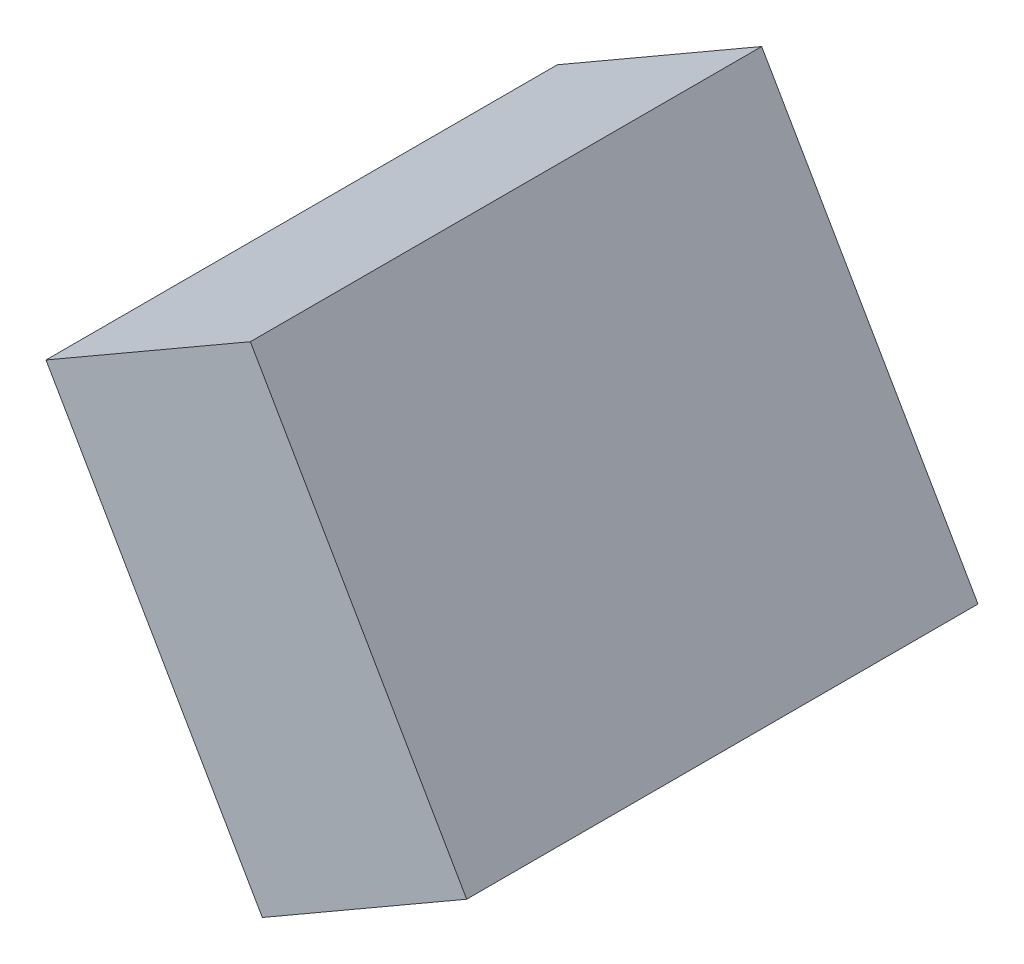
ISO-10303-21;
HEADER;
FILE_DESCRIPTION(('STEP AP214'),'2;1');
FILE_NAME('part.step','',(''),(''),'','','');
FILE_SCHEMA(('AUTOMOTIVE_DESIGN { 1 0 10303 214 1 1 1 1 }'));
ENDSEC;
DATA;
#1=APPLICATION_CONTEXT('core data for automotive mechanical design processes');
#2=APPLICATION_PROTOCOL_DEFINITION('international standard','automotive_design',2000,#1);
#3=PRODUCT_CONTEXT('',#1,'mechanical');
#4=PRODUCT('Part','Part','',(#3));
#5=PRODUCT_RELATED_PRODUCT_CATEGORY('part','',(#4));
#6=PRODUCT_DEFINITION_FORMATION('','',#4);
#7=PRODUCT_DEFINITION_CONTEXT('part definition',#1,'design');
#8=PRODUCT_DEFINITION('design','',#6,#7);
#9=PRODUCT_DEFINITION_SHAPE('','',#8);
#10=(LENGTH_UNIT() NAMED_UNIT(*) SI_UNIT(.MILLI.,.METRE.));
#11=(NAMED_UNIT(*) PLANE_ANGLE_UNIT() SI_UNIT($,.RADIAN.));
#12=(NAMED_UNIT(*) SI_UNIT($,.STERADIAN.) SOLID_ANGLE_UNIT());
#13=UNCERTAINTY_MEASURE_WITH_UNIT(LENGTH_MEASURE(1.E-05),#10,'distance_accuracy_value','');
#14=(GEOMETRIC_REPRESENTATION_CONTEXT(3) GLOBAL_UNCERTAINTY_ASSIGNED_CONTEXT((#13)) GLOBAL_UNIT_ASSIGNED_CONTEXT((#10,
#11,#12)) REPRESENTATION_CONTEXT('',''));
#15=CARTESIAN_POINT('',(0.,0.,0.));
#16=DIRECTION('',(0.,0.,1.));
#17=DIRECTION('',(1.,0.,0.));
#18=AXIS2_PLACEMENT_3D('',#15,#16,#17);
#19=CARTESIAN_POINT('',(-0.53480462,0.3263138,0.));
#20=DIRECTION('',(0.866024622348075,0.500001353485043,0.));
#21=DIRECTION('',(-0.500001353485043,0.866024622348075,0.));
#22=AXIS2_PLACEMENT_3D('',#19,#20,#21);
#23=PLANE('',#22);
#24=DIRECTION('',(0.,0.,1.));
#25=VECTOR('',#24,1.);
#26=CARTESIAN_POINT('',(0.01519682,-0.6263132,0.));
#27=LINE('',#26,#25);
#28=CARTESIAN_POINT('',(0.0151968199998915,-0.626313200000063,0.));
#29=VERTEX_POINT('',#28);
#30=CARTESIAN_POINT('',(0.0151968199998915,-0.626313200000063,1.29999994));
#31=VERTEX_POINT('',#30);
#32=EDGE_CURVE('E20',#29,#31,#27,.T.);
#33=ORIENTED_EDGE('',*,*,#32,.T.);
#34=DIRECTION('',(-0.500001353485438,0.866024622347847,0.));
#35=VECTOR('',#34,1.);
#36=CARTESIAN_POINT('',(0.01519682,-0.6263132,1.29999994));
#37=LINE('',#36,#35);
#38=CARTESIAN_POINT('',(-0.534804620000028,0.326313800000049,1.29999994));
#39=VERTEX_POINT('',#38);
#40=EDGE_CURVE('E55',#31,#39,#37,.T.);
#41=ORIENTED_EDGE('',*,*,#40,.T.);
#42=DIRECTION('',(0.,0.,1.));
#43=VECTOR('',#42,1.);
#44=CARTESIAN_POINT('',(-0.534804620000113,0.326313800000195,0.));
#45=LINE('',#44,#43);
#46=CARTESIAN_POINT('',(-0.534804620000056,0.326313800000098,0.));
#47=VERTEX_POINT('',#46);
#48=EDGE_CURVE('E76',#39,#47,#45,.F.);
#49=ORIENTED_EDGE('',*,*,#48,.T.);
#50=DIRECTION('',(-0.500001353485438,0.866024622347847,0.));
#51=VECTOR('',#50,1.);
#52=CARTESIAN_POINT('',(0.01519682,-0.6263132,0.));
#53=LINE('',#52,#51);
#54=EDGE_CURVE('E58',#29,#47,#53,.T.);
#55=ORIENTED_EDGE('',*,*,#54,.F.);
#56=EDGE_LOOP('',(#33,#41,#49,#55));
#57=FACE_BOUND('',#56,.T.);
#58=ADVANCED_FACE('F17',(#57),#23,.F.);
#59=CARTESIAN_POINT('',(0.01519682,-0.6263132,0.));
#60=DIRECTION('',(-0.499999612904881,0.866025627273794,0.));
#61=DIRECTION('',(-0.866025627273794,-0.499999612904881,0.));
#62=AXIS2_PLACEMENT_3D('',#59,#60,#61);
#63=PLANE('',#62);
#64=DIRECTION('',(0.,0.,1.));
#65=VECTOR('',#64,1.);
#66=CARTESIAN_POINT('',(0.53480716,-0.32631634,0.));
#67=LINE('',#66,#65);
#68=CARTESIAN_POINT('',(0.534807160000074,-0.326316340000128,0.));
#69=VERTEX_POINT('',#68);
#70=CARTESIAN_POINT('',(0.534807160000074,-0.326316340000128,1.29999994));
#71=VERTEX_POINT('',#70);
#72=EDGE_CURVE('E73',#69,#71,#67,.T.);
#73=ORIENTED_EDGE('',*,*,#72,.T.);
#74=DIRECTION('',(-0.866025627273549,-0.499999612905307,0.));
#75=VECTOR('',#74,1.);
#76=CARTESIAN_POINT('',(0.53480716,-0.32631634,1.29999994));
#77=LINE('',#76,#75);
#78=EDGE_CURVE('E63',#71,#31,#77,.T.);
#79=ORIENTED_EDGE('',*,*,#78,.T.);
#80=ORIENTED_EDGE('',*,*,#32,.F.);
#81=DIRECTION('',(-0.866025627273549,-0.499999612905307,0.));
#82=VECTOR('',#81,1.);
#83=CARTESIAN_POINT('',(0.53480716,-0.32631634,0.));
#84=LINE('',#83,#82);
#85=EDGE_CURVE('E79',#69,#29,#84,.T.);
#86=ORIENTED_EDGE('',*,*,#85,.F.);
#87=EDGE_LOOP('',(#73,#79,#80,#86));
#88=FACE_BOUND('',#87,.T.);
#89=ADVANCED_FACE('F72',(#88),#63,.F.);
#90=CARTESIAN_POINT('',(-0.53480462,0.3263138,1.29999994));
#91=DIRECTION('',(0.,0.,-1.));
#92=DIRECTION('',(-1.,0.,0.));
#93=AXIS2_PLACEMENT_3D('',#90,#91,#92);
#94=PLANE('',#93);
#95=ORIENTED_EDGE('',*,*,#78,.F.);
#96=DIRECTION('',(0.499998621801984,-0.866026199485972,0.));
#97=VECTOR('',#96,1.);
#98=CARTESIAN_POINT('',(0.53480716,-0.32631634,1.29999994));
#99=LINE('',#98,#97);
#100=CARTESIAN_POINT('',(-0.0151917399998767,0.626313200000077,1.29999994));
#101=VERTEX_POINT('',#100);
#102=EDGE_CURVE('E83',#71,#101,#99,.F.);
#103=ORIENTED_EDGE('',*,*,#102,.T.);
#104=DIRECTION('',(0.8660248525152,0.500000954825115,0.));
#105=VECTOR('',#104,1.);
#106=CARTESIAN_POINT('',(-0.01519174000001,0.6263132,1.29999994));
#107=LINE('',#106,#105);
#108=EDGE_CURVE('E69',#101,#39,#107,.F.);
#109=ORIENTED_EDGE('',*,*,#108,.T.);
#110=ORIENTED_EDGE('',*,*,#40,.F.);
#111=EDGE_LOOP('',(#95,#103,#109,#110));
#112=FACE_BOUND('',#111,.T.);
#113=ADVANCED_FACE('F66',(#112),#94,.F.);
#114=CARTESIAN_POINT('',(-0.01519174000001,0.6263132,0.));
#115=DIRECTION('',(0.500000954825115,-0.8660248525152,0.));
#116=DIRECTION('',(0.8660248525152,0.500000954825115,0.));
#117=AXIS2_PLACEMENT_3D('',#114,#115,#116);
#118=PLANE('',#117);
#119=ORIENTED_EDGE('',*,*,#48,.F.);
#120=ORIENTED_EDGE('',*,*,#108,.F.);
#121=DIRECTION('',(0.,0.,1.));
#122=VECTOR('',#121,1.);
#123=CARTESIAN_POINT('',(-0.0151917399994766,0.626313200000308,0.));
#124=LINE('',#123,#122);
#125=CARTESIAN_POINT('',(-0.0151917399998767,0.626313200000077,0.));
#126=VERTEX_POINT('',#125);
#127=EDGE_CURVE('E26',#101,#126,#124,.F.);
#128=ORIENTED_EDGE('',*,*,#127,.T.);
#129=DIRECTION('',(0.866024852515012,0.500000954825441,0.));
#130=VECTOR('',#129,1.);
#131=CARTESIAN_POINT('',(-0.53480462,0.3263138,0.));
#132=LINE('',#131,#130);
#133=EDGE_CURVE('E34',#47,#126,#132,.T.);
#134=ORIENTED_EDGE('',*,*,#133,.F.);
#135=EDGE_LOOP('',(#119,#120,#128,#134));
#136=FACE_BOUND('',#135,.T.);
#137=ADVANCED_FACE('F88',(#136),#118,.F.);
#138=CARTESIAN_POINT('',(-0.53480462,0.3263138,0.));
#139=DIRECTION('',(0.,0.,-1.));
#140=DIRECTION('',(-1.,0.,0.));
#141=AXIS2_PLACEMENT_3D('',#138,#139,#140);
#142=PLANE('',#141);
#143=ORIENTED_EDGE('',*,*,#85,.T.);
#144=ORIENTED_EDGE('',*,*,#54,.T.);
#145=ORIENTED_EDGE('',*,*,#133,.T.);
#146=DIRECTION('',(0.499998621801984,-0.866026199485972,0.));
#147=VECTOR('',#146,1.);
#148=CARTESIAN_POINT('',(0.53480716,-0.32631634,0.));
#149=LINE('',#148,#147);
#150=EDGE_CURVE('E11',#126,#69,#149,.T.);
#151=ORIENTED_EDGE('',*,*,#150,.T.);
#152=EDGE_LOOP('',(#143,#144,#145,#151));
#153=FACE_BOUND('',#152,.T.);
#154=ADVANCED_FACE('F91',(#153),#142,.T.);
#155=CARTESIAN_POINT('',(0.53480716,-0.32631634,0.));
#156=DIRECTION('',(-0.866026199485972,-0.499998621801984,0.));
#157=DIRECTION('',(0.499998621801984,-0.866026199485972,0.));
#158=AXIS2_PLACEMENT_3D('',#155,#156,#157);
#159=PLANE('',#158);
#160=ORIENTED_EDGE('',*,*,#127,.F.);
#161=ORIENTED_EDGE('',*,*,#102,.F.);
#162=ORIENTED_EDGE('',*,*,#72,.F.);
#163=ORIENTED_EDGE('',*,*,#150,.F.);
#164=EDGE_LOOP('',(#160,#161,#162,#163));
#165=FACE_BOUND('',#164,.T.);
#166=ADVANCED_FACE('F90',(#165),#159,.F.);
#167=CLOSED_SHELL('',(#58,#89,#113,#137,#154,#166));
#168=MANIFOLD_SOLID_BREP('B1',#167);
#169=ADVANCED_BREP_SHAPE_REPRESENTATION('',(#18,#168),#14);
#170=SHAPE_DEFINITION_REPRESENTATION(#9,#169);
ENDSEC;
END-ISO-10303-21;
